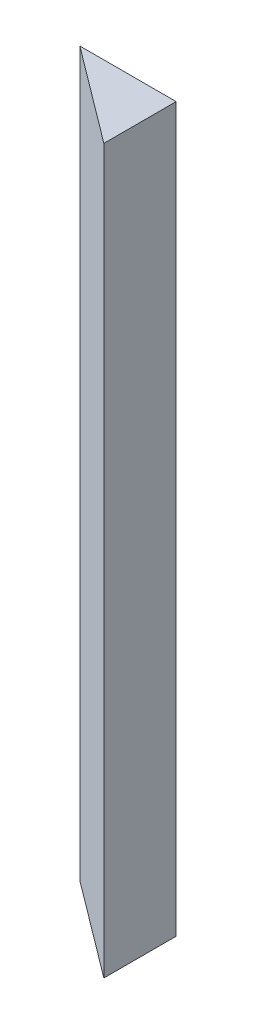
ISO-10303-21;
HEADER;
FILE_DESCRIPTION(('STEP AP214'),'2;1');
FILE_NAME('part.step','',(''),(''),'','','');
FILE_SCHEMA(('AUTOMOTIVE_DESIGN { 1 0 10303 214 1 1 1 1 }'));
ENDSEC;
DATA;
#1=APPLICATION_CONTEXT('core data for automotive mechanical design processes');
#2=APPLICATION_PROTOCOL_DEFINITION('international standard','automotive_design',2000,#1);
#3=PRODUCT_CONTEXT('',#1,'mechanical');
#4=PRODUCT('Part','Part','',(#3));
#5=PRODUCT_RELATED_PRODUCT_CATEGORY('part','',(#4));
#6=PRODUCT_DEFINITION_FORMATION('','',#4);
#7=PRODUCT_DEFINITION_CONTEXT('part definition',#1,'design');
#8=PRODUCT_DEFINITION('design','',#6,#7);
#9=PRODUCT_DEFINITION_SHAPE('','',#8);
#10=(LENGTH_UNIT() NAMED_UNIT(*) SI_UNIT(.MILLI.,.METRE.));
#11=(NAMED_UNIT(*) PLANE_ANGLE_UNIT() SI_UNIT($,.RADIAN.));
#12=(NAMED_UNIT(*) SI_UNIT($,.STERADIAN.) SOLID_ANGLE_UNIT());
#13=UNCERTAINTY_MEASURE_WITH_UNIT(LENGTH_MEASURE(1.E-05),#10,'distance_accuracy_value','');
#14=(GEOMETRIC_REPRESENTATION_CONTEXT(3) GLOBAL_UNCERTAINTY_ASSIGNED_CONTEXT((#13)) GLOBAL_UNIT_ASSIGNED_CONTEXT((#10,
#11,#12)) REPRESENTATION_CONTEXT('',''));
#15=CARTESIAN_POINT('',(0.,0.,0.));
#16=DIRECTION('',(0.,0.,1.));
#17=DIRECTION('',(1.,0.,0.));
#18=AXIS2_PLACEMENT_3D('',#15,#16,#17);
#19=CARTESIAN_POINT('',(3.90666097759878,-0.75000097971643,-2.35778269529518));
#20=DIRECTION('',(1.74845553146952E-07,1.,8.74227765734759E-08));
#21=DIRECTION('',(-1.,1.74845553146952E-07,0.));
#22=AXIS2_PLACEMENT_3D('',#19,#20,#21);
#23=PLANE('',#22);
#24=DIRECTION('',(0.799759704949019,-1.92316092216546E-07,0.600320259811229));
#25=VECTOR('',#24,1.);
#26=CARTESIAN_POINT('',(3.76677769422178,-0.750000955840793,-2.35112158656318));
#27=LINE('',#26,#25);
#28=CARTESIAN_POINT('',(3.76677769422178,-0.750000955842793,-2.35112158656318));
#29=VERTEX_POINT('',#28);
#30=CARTESIAN_POINT('',(3.89999986886578,-0.750000987878375,-2.25112158656318));
#31=VERTEX_POINT('',#30);
#32=EDGE_CURVE('E11',#29,#31,#27,.T.);
#33=ORIENTED_EDGE('',*,*,#32,.T.);
#34=DIRECTION('',(0.,8.74227767955201E-08,-0.999999999999996));
#35=VECTOR('',#34,1.);
#36=CARTESIAN_POINT('',(3.89999986886578,-0.750000987876375,-2.25112158656318));
#37=LINE('',#36,#35);
#38=CARTESIAN_POINT('',(3.89999986886578,-0.750000979136098,-2.35112158656318));
#39=VERTEX_POINT('',#38);
#40=EDGE_CURVE('E49',#31,#39,#37,.T.);
#41=ORIENTED_EDGE('',*,*,#40,.T.);
#42=DIRECTION('',(-0.999999999999985,1.74845553322982E-07,0.));
#43=VECTOR('',#42,1.);
#44=CARTESIAN_POINT('',(3.89999986886578,-0.750000979134098,-2.35112158656318));
#45=LINE('',#44,#43);
#46=EDGE_CURVE('E47',#39,#29,#45,.T.);
#47=ORIENTED_EDGE('',*,*,#46,.T.);
#48=EDGE_LOOP('',(#33,#41,#47));
#49=FACE_BOUND('',#48,.T.);
#50=ADVANCED_FACE('F17',(#49),#23,.T.);
#51=CARTESIAN_POINT('',(3.90666080275323,-1.75000097971743,-2.35778278271795));
#52=DIRECTION('',(1.74845553146952E-07,1.,8.74227765734759E-08));
#53=DIRECTION('',(-1.,1.74845553146952E-07,0.));
#54=AXIS2_PLACEMENT_3D('',#51,#52,#53);
#55=PLANE('',#54);
#56=DIRECTION('',(-0.999999999999985,1.74845553322983E-07,0.));
#57=VECTOR('',#56,1.);
#58=CARTESIAN_POINT('',(3.89999969402023,-1.7500009791351,-2.35112167398595));
#59=LINE('',#58,#57);
#60=CARTESIAN_POINT('',(3.89999969402023,-1.7500009791341,-2.35112167398595));
#61=VERTEX_POINT('',#60);
#62=CARTESIAN_POINT('',(3.76677751937623,-1.75000095584079,-2.35112167398595));
#63=VERTEX_POINT('',#62);
#64=EDGE_CURVE('E24',#61,#63,#59,.T.);
#65=ORIENTED_EDGE('',*,*,#64,.F.);
#66=DIRECTION('',(0.,8.74227779057435E-08,-0.999999999999996));
#67=VECTOR('',#66,1.);
#68=CARTESIAN_POINT('',(3.89999969402023,-1.75000098787738,-2.25112167398595));
#69=LINE('',#68,#67);
#70=CARTESIAN_POINT('',(3.89999969402023,-1.75000098787638,-2.25112167398595));
#71=VERTEX_POINT('',#70);
#72=EDGE_CURVE('E53',#71,#61,#69,.T.);
#73=ORIENTED_EDGE('',*,*,#72,.F.);
#74=DIRECTION('',(0.799759704949019,-1.92316092883035E-07,0.600320259811229));
#75=VECTOR('',#74,1.);
#76=CARTESIAN_POINT('',(3.76677751937623,-1.75000095584179,-2.35112167398595));
#77=LINE('',#76,#75);
#78=EDGE_CURVE('E68',#63,#71,#77,.T.);
#79=ORIENTED_EDGE('',*,*,#78,.F.);
#80=EDGE_LOOP('',(#65,#73,#79));
#81=FACE_BOUND('',#80,.T.);
#82=ADVANCED_FACE('F73',(#81),#55,.F.);
#83=CARTESIAN_POINT('',(3.76677769422178,-0.750000955840793,-2.35112158656318));
#84=DIRECTION('',(0.600320259811247,-3.50461138937884E-08,-0.799759704949038));
#85=DIRECTION('',(0.799759704949028,-1.92316091942466E-07,0.600320259811235));
#86=AXIS2_PLACEMENT_3D('',#83,#84,#85);
#87=PLANE('',#86);
#88=DIRECTION('',(-1.74845553146774E-07,-0.999999999999981,-8.74227765733868E-08));
#89=VECTOR('',#88,1.);
#90=CARTESIAN_POINT('',(3.76677769422178,-0.750000955840793,-2.35112158656318));
#91=LINE('',#90,#89);
#92=EDGE_CURVE('E59',#29,#63,#91,.T.);
#93=ORIENTED_EDGE('',*,*,#92,.T.);
#94=ORIENTED_EDGE('',*,*,#78,.T.);
#95=DIRECTION('',(-1.74845553146773E-07,-0.999999999999981,-8.74227765733867E-08));
#96=VECTOR('',#95,1.);
#97=CARTESIAN_POINT('',(3.89999986886578,-0.750000987876375,-2.25112158656318));
#98=LINE('',#97,#96);
#99=EDGE_CURVE('E54',#31,#71,#98,.T.);
#100=ORIENTED_EDGE('',*,*,#99,.F.);
#101=ORIENTED_EDGE('',*,*,#32,.F.);
#102=EDGE_LOOP('',(#93,#94,#100,#101));
#103=FACE_BOUND('',#102,.T.);
#104=ADVANCED_FACE('F57',(#103),#87,.F.);
#105=CARTESIAN_POINT('',(3.89999986886578,-0.750000987876375,-2.25112158656318));
#106=DIRECTION('',(-1.,1.74845553146952E-07,0.));
#107=DIRECTION('',(0.,8.74227765734759E-08,-1.));
#108=AXIS2_PLACEMENT_3D('',#105,#106,#107);
#109=PLANE('',#108);
#110=ORIENTED_EDGE('',*,*,#99,.T.);
#111=ORIENTED_EDGE('',*,*,#72,.T.);
#112=DIRECTION('',(-1.74845553146774E-07,-0.999999999999981,-8.74227765733868E-08));
#113=VECTOR('',#112,1.);
#114=CARTESIAN_POINT('',(3.89999986886578,-0.750000979134097,-2.35112158656318));
#115=LINE('',#114,#113);
#116=EDGE_CURVE('E70',#39,#61,#115,.T.);
#117=ORIENTED_EDGE('',*,*,#116,.F.);
#118=ORIENTED_EDGE('',*,*,#40,.F.);
#119=EDGE_LOOP('',(#110,#111,#117,#118));
#120=FACE_BOUND('',#119,.T.);
#121=ADVANCED_FACE('F72',(#120),#109,.F.);
#122=CARTESIAN_POINT('',(3.89999986886578,-0.750000979134098,-2.35112158656318));
#123=DIRECTION('',(0.,-8.74227765734759E-08,1.));
#124=DIRECTION('',(-1.,1.74845553146952E-07,0.));
#125=AXIS2_PLACEMENT_3D('',#122,#123,#124);
#126=PLANE('',#125);
#127=ORIENTED_EDGE('',*,*,#116,.T.);
#128=ORIENTED_EDGE('',*,*,#64,.T.);
#129=ORIENTED_EDGE('',*,*,#92,.F.);
#130=ORIENTED_EDGE('',*,*,#46,.F.);
#131=EDGE_LOOP('',(#127,#128,#129,#130));
#132=FACE_BOUND('',#131,.T.);
#133=ADVANCED_FACE('F61',(#132),#126,.F.);
#134=CLOSED_SHELL('',(#50,#82,#104,#121,#133));
#135=MANIFOLD_SOLID_BREP('B1',#134);
#136=ADVANCED_BREP_SHAPE_REPRESENTATION('',(#18,#135),#14);
#137=SHAPE_DEFINITION_REPRESENTATION(#9,#136);
ENDSEC;
END-ISO-10303-21;
